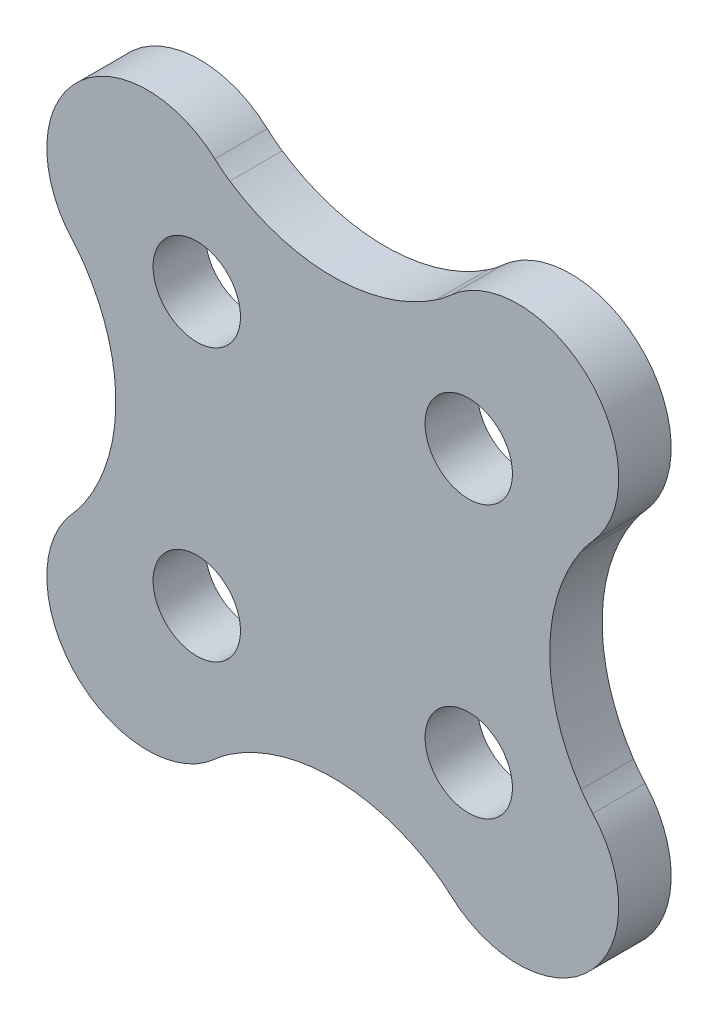
ISO-10303-21;
HEADER;
FILE_DESCRIPTION(('STEP AP214'),'2;1');
FILE_NAME('part.step','',(''),(''),'','','');
FILE_SCHEMA(('AUTOMOTIVE_DESIGN { 1 0 10303 214 1 1 1 1 }'));
ENDSEC;
DATA;
#1=APPLICATION_CONTEXT('core data for automotive mechanical design processes');
#2=APPLICATION_PROTOCOL_DEFINITION('international standard','automotive_design',2000,#1);
#3=PRODUCT_CONTEXT('',#1,'mechanical');
#4=PRODUCT('Part','Part','',(#3));
#5=PRODUCT_RELATED_PRODUCT_CATEGORY('part','',(#4));
#6=PRODUCT_DEFINITION_FORMATION('','',#4);
#7=PRODUCT_DEFINITION_CONTEXT('part definition',#1,'design');
#8=PRODUCT_DEFINITION('design','',#6,#7);
#9=PRODUCT_DEFINITION_SHAPE('','',#8);
#10=(LENGTH_UNIT() NAMED_UNIT(*) SI_UNIT(.MILLI.,.METRE.));
#11=(NAMED_UNIT(*) PLANE_ANGLE_UNIT() SI_UNIT($,.RADIAN.));
#12=(NAMED_UNIT(*) SI_UNIT($,.STERADIAN.) SOLID_ANGLE_UNIT());
#13=UNCERTAINTY_MEASURE_WITH_UNIT(LENGTH_MEASURE(1.E-05),#10,'distance_accuracy_value','');
#14=(GEOMETRIC_REPRESENTATION_CONTEXT(3) GLOBAL_UNCERTAINTY_ASSIGNED_CONTEXT((#13)) GLOBAL_UNIT_ASSIGNED_CONTEXT((#10,
#11,#12)) REPRESENTATION_CONTEXT('',''));
#15=CARTESIAN_POINT('',(0.,0.,0.));
#16=DIRECTION('',(0.,0.,1.));
#17=DIRECTION('',(1.,0.,0.));
#18=AXIS2_PLACEMENT_3D('',#15,#16,#17);
#19=CARTESIAN_POINT('',(8.97753154086215,16.3429104568438,1.2));
#20=DIRECTION('',(0.,0.,1.));
#21=DIRECTION('',(1.,0.,0.));
#22=AXIS2_PLACEMENT_3D('',#19,#20,#21);
#23=PLANE('',#22);
#24=CARTESIAN_POINT('',(12.0735176604385,16.989962178256,1.2));
#25=DIRECTION('',(0.,0.,1.));
#26=DIRECTION('',(1.,0.,0.));
#27=AXIS2_PLACEMENT_3D('',#24,#25,#26);
#28=CIRCLE('',#27,1.);
#29=CARTESIAN_POINT('',(13.0735176604385,16.989962178256,1.2));
#30=VERTEX_POINT('',#29);
#31=EDGE_CURVE('E773',#30,#30,#28,.T.);
#32=ORIENTED_EDGE('',*,*,#31,.F.);
#33=EDGE_LOOP('',(#32));
#34=FACE_BOUND('',#33,.T.);
#35=CARTESIAN_POINT('',(18.29605733488,10.7674225038145,1.2));
#36=DIRECTION('',(0.,0.,1.));
#37=DIRECTION('',(1.,0.,0.));
#38=AXIS2_PLACEMENT_3D('',#35,#36,#37);
#39=CIRCLE('',#38,1.);
#40=CARTESIAN_POINT('',(19.29605733488,10.7674225038145,1.2));
#41=VERTEX_POINT('',#40);
#42=EDGE_CURVE('E396',#41,#41,#39,.T.);
#43=ORIENTED_EDGE('',*,*,#42,.F.);
#44=EDGE_LOOP('',(#43));
#45=FACE_BOUND('',#44,.T.);
#46=CARTESIAN_POINT('',(10.94214681054,18.1213330281545,1.2));
#47=DIRECTION('',(0.,0.,1.));
#48=DIRECTION('',(1.,0.,0.));
#49=AXIS2_PLACEMENT_3D('',#46,#47,#48);
#50=CIRCLE('',#49,2.30000000000002);
#51=CARTESIAN_POINT('',(12.4856833818662,19.8264708093848,1.2));
#52=VERTEX_POINT('',#51);
#53=CARTESIAN_POINT('',(9.23700902930997,16.5777964568282,1.2));
#54=VERTEX_POINT('',#53);
#55=EDGE_CURVE('E322',#52,#54,#50,.T.);
#56=ORIENTED_EDGE('',*,*,#55,.T.);
#57=CARTESIAN_POINT('',(7.01291627118427,14.564487885533,1.2));
#58=DIRECTION('',(0.,0.,1.));
#59=DIRECTION('',(1.,0.,0.));
#60=AXIS2_PLACEMENT_3D('',#57,#58,#59);
#61=CIRCLE('',#60,2.99999999999961);
#62=CARTESIAN_POINT('',(9.50489487840609,16.2348299526398,1.2));
#63=VERTEX_POINT('',#62);
#64=EDGE_CURVE('E510',#63,#54,#61,.T.);
#65=ORIENTED_EDGE('',*,*,#64,.F.);
#66=CARTESIAN_POINT('',(5.98977983735266,13.8786923410353,1.2));
#67=DIRECTION('',(0.,0.,1.));
#68=DIRECTION('',(1.,0.,0.));
#69=AXIS2_PLACEMENT_3D('',#66,#67,#68);
#70=CIRCLE('',#69,4.23171575092862);
#71=CARTESIAN_POINT('',(9.50489487840625,11.5225547294311,1.2));
#72=VERTEX_POINT('',#71);
#73=EDGE_CURVE('E495',#72,#63,#70,.T.);
#74=ORIENTED_EDGE('',*,*,#73,.F.);
#75=CARTESIAN_POINT('',(7.01291627118376,13.192896796537,1.2));
#76=DIRECTION('',(0.,0.,1.));
#77=DIRECTION('',(1.,0.,0.));
#78=AXIS2_PLACEMENT_3D('',#75,#76,#77);
#79=CIRCLE('',#78,2.99999999999973);
#80=CARTESIAN_POINT('',(9.23700902930996,11.1795882252423,1.2));
#81=VERTEX_POINT('',#80);
#82=EDGE_CURVE('E509',#81,#72,#79,.T.);
#83=ORIENTED_EDGE('',*,*,#82,.F.);
#84=CARTESIAN_POINT('',(10.9421468105401,9.63605165391596,1.2));
#85=DIRECTION('',(0.,0.,1.));
#86=DIRECTION('',(1.,0.,0.));
#87=AXIS2_PLACEMENT_3D('',#84,#85,#86);
#88=CIRCLE('',#87,2.30000000000002);
#89=CARTESIAN_POINT('',(12.4856833818663,7.9309138726858,1.2));
#90=VERTEX_POINT('',#89);
#91=EDGE_CURVE('E515',#81,#90,#88,.T.);
#92=ORIENTED_EDGE('',*,*,#91,.T.);
#93=CARTESIAN_POINT('',(14.4989919531628,5.70682111455984,1.2));
#94=DIRECTION('',(0.,0.,1.));
#95=DIRECTION('',(1.,0.,0.));
#96=AXIS2_PLACEMENT_3D('',#93,#94,#95);
#97=CIRCLE('',#96,3.00000000000069);
#98=CARTESIAN_POINT('',(12.828649886055,8.19879972178226,1.2));
#99=VERTEX_POINT('',#98);
#100=EDGE_CURVE('E522',#99,#90,#97,.T.);
#101=ORIENTED_EDGE('',*,*,#100,.F.);
#102=CARTESIAN_POINT('',(15.1847874976592,4.68368468072872,1.2));
#103=DIRECTION('',(0.,0.,1.));
#104=DIRECTION('',(1.,0.,0.));
#105=AXIS2_PLACEMENT_3D('',#102,#103,#104);
#106=CIRCLE('',#105,4.23171575092856);
#107=CARTESIAN_POINT('',(17.5409251092637,8.19879972178209,1.2));
#108=VERTEX_POINT('',#107);
#109=EDGE_CURVE('E526',#108,#99,#106,.T.);
#110=ORIENTED_EDGE('',*,*,#109,.F.);
#111=CARTESIAN_POINT('',(15.8705830421569,5.70682111456031,1.2));
#112=DIRECTION('',(0.,0.,1.));
#113=DIRECTION('',(1.,0.,0.));
#114=AXIS2_PLACEMENT_3D('',#111,#112,#113);
#115=CIRCLE('',#114,2.9999999999996);
#116=CARTESIAN_POINT('',(17.8838916134524,7.9309138726857,1.2));
#117=VERTEX_POINT('',#116);
#118=EDGE_CURVE('E530',#117,#108,#115,.T.);
#119=ORIENTED_EDGE('',*,*,#118,.F.);
#120=CARTESIAN_POINT('',(19.4274281847784,9.63605165391604,1.2));
#121=DIRECTION('',(0.,0.,1.));
#122=DIRECTION('',(1.,0.,0.));
#123=AXIS2_PLACEMENT_3D('',#120,#121,#122);
#124=CIRCLE('',#123,2.30000000000002);
#125=CARTESIAN_POINT('',(21.1325659660086,11.1795882252423,1.2));
#126=VERTEX_POINT('',#125);
#127=EDGE_CURVE('E534',#117,#126,#124,.T.);
#128=ORIENTED_EDGE('',*,*,#127,.T.);
#129=CARTESIAN_POINT('',(23.3566587241348,13.192896796537,1.2));
#130=DIRECTION('',(0.,0.,1.));
#131=DIRECTION('',(1.,0.,0.));
#132=AXIS2_PLACEMENT_3D('',#129,#130,#131);
#133=CIRCLE('',#132,2.99999999999973);
#134=CARTESIAN_POINT('',(20.8646801169123,11.5225547294311,1.2));
#135=VERTEX_POINT('',#134);
#136=EDGE_CURVE('E537',#135,#126,#133,.T.);
#137=ORIENTED_EDGE('',*,*,#136,.F.);
#138=CARTESIAN_POINT('',(24.3797951579659,13.8786923410353,1.2));
#139=DIRECTION('',(0.,0.,1.));
#140=DIRECTION('',(1.,0.,0.));
#141=AXIS2_PLACEMENT_3D('',#138,#139,#140);
#142=CIRCLE('',#141,4.23171575092862);
#143=CARTESIAN_POINT('',(20.8646801169124,16.2348299526398,1.2));
#144=VERTEX_POINT('',#143);
#145=EDGE_CURVE('E541',#144,#135,#142,.T.);
#146=ORIENTED_EDGE('',*,*,#145,.F.);
#147=CARTESIAN_POINT('',(23.3566587241343,14.564487885533,1.2));
#148=DIRECTION('',(0.,0.,1.));
#149=DIRECTION('',(1.,0.,0.));
#150=AXIS2_PLACEMENT_3D('',#147,#148,#149);
#151=CIRCLE('',#150,2.99999999999962);
#152=CARTESIAN_POINT('',(21.1325659660086,16.5777964568282,1.2));
#153=VERTEX_POINT('',#152);
#154=EDGE_CURVE('E545',#153,#144,#151,.T.);
#155=ORIENTED_EDGE('',*,*,#154,.F.);
#156=CARTESIAN_POINT('',(19.4274281847785,18.1213330281545,1.2));
#157=DIRECTION('',(0.,0.,1.));
#158=DIRECTION('',(1.,0.,0.));
#159=AXIS2_PLACEMENT_3D('',#156,#157,#158);
#160=CIRCLE('',#159,2.30000000000003);
#161=CARTESIAN_POINT('',(17.8838916134523,19.8264708093848,1.2));
#162=VERTEX_POINT('',#161);
#163=EDGE_CURVE('E380',#153,#162,#160,.T.);
#164=ORIENTED_EDGE('',*,*,#163,.T.);
#165=CARTESIAN_POINT('',(15.870583042157,22.0505635675103,1.2));
#166=DIRECTION('',(0.,0.,1.));
#167=DIRECTION('',(1.,0.,0.));
#168=AXIS2_PLACEMENT_3D('',#165,#166,#167);
#169=CIRCLE('',#168,2.99999999999965);
#170=CARTESIAN_POINT('',(17.5409251092636,19.5585849602883,1.2));
#171=VERTEX_POINT('',#170);
#172=EDGE_CURVE('E366',#171,#162,#169,.T.);
#173=ORIENTED_EDGE('',*,*,#172,.F.);
#174=CARTESIAN_POINT('',(15.1847874976593,23.0737000013419,1.2));
#175=DIRECTION('',(0.,0.,1.));
#176=DIRECTION('',(1.,0.,0.));
#177=AXIS2_PLACEMENT_3D('',#174,#175,#176);
#178=CIRCLE('',#177,4.23171575092862);
#179=CARTESIAN_POINT('',(12.828649886055,19.5585849602884,1.2));
#180=VERTEX_POINT('',#179);
#181=EDGE_CURVE('E377',#180,#171,#178,.T.);
#182=ORIENTED_EDGE('',*,*,#181,.F.);
#183=CARTESIAN_POINT('',(14.4989919531611,22.0505635675107,1.2));
#184=DIRECTION('',(0.,0.,1.));
#185=DIRECTION('',(1.,0.,0.));
#186=AXIS2_PLACEMENT_3D('',#183,#184,#185);
#187=CIRCLE('',#186,2.99999999999961);
#188=EDGE_CURVE('E386',#52,#180,#187,.T.);
#189=ORIENTED_EDGE('',*,*,#188,.F.);
#190=EDGE_LOOP('',(#56,#65,#74,#83,#92,#101,#110,#119,#128,#137,#146,#155,#164,#173,#182,#189));
#191=FACE_BOUND('',#190,.T.);
#192=CARTESIAN_POINT('',(12.0735176604385,10.7674225038145,1.2));
#193=DIRECTION('',(0.,0.,1.));
#194=DIRECTION('',(1.,0.,0.));
#195=AXIS2_PLACEMENT_3D('',#192,#193,#194);
#196=CIRCLE('',#195,0.999999999999999);
#197=CARTESIAN_POINT('',(13.0735176604385,10.7674225038145,1.2));
#198=VERTEX_POINT('',#197);
#199=EDGE_CURVE('E765',#198,#198,#196,.T.);
#200=ORIENTED_EDGE('',*,*,#199,.F.);
#201=EDGE_LOOP('',(#200));
#202=FACE_BOUND('',#201,.T.);
#203=CARTESIAN_POINT('',(18.29605733488,16.989962178256,1.2));
#204=DIRECTION('',(0.,0.,1.));
#205=DIRECTION('',(1.,0.,0.));
#206=AXIS2_PLACEMENT_3D('',#203,#204,#205);
#207=CIRCLE('',#206,1.);
#208=CARTESIAN_POINT('',(19.29605733488,16.989962178256,1.2));
#209=VERTEX_POINT('',#208);
#210=EDGE_CURVE('E781',#209,#209,#207,.T.);
#211=ORIENTED_EDGE('',*,*,#210,.F.);
#212=EDGE_LOOP('',(#211));
#213=FACE_BOUND('',#212,.T.);
#214=ADVANCED_FACE('F243',(#34,#45,#191,#202,#213),#23,.T.);
#215=CARTESIAN_POINT('',(8.97753154086215,16.3429104568438,0.));
#216=DIRECTION('',(0.,0.,1.));
#217=DIRECTION('',(1.,0.,0.));
#218=AXIS2_PLACEMENT_3D('',#215,#216,#217);
#219=PLANE('',#218);
#220=CARTESIAN_POINT('',(10.94214681054,18.1213330281545,0.));
#221=DIRECTION('',(0.,0.,1.));
#222=DIRECTION('',(1.,0.,0.));
#223=AXIS2_PLACEMENT_3D('',#220,#221,#222);
#224=CIRCLE('',#223,2.30000000000002);
#225=CARTESIAN_POINT('',(12.4856833818662,19.8264708093848,0.));
#226=VERTEX_POINT('',#225);
#227=CARTESIAN_POINT('',(9.23700902930997,16.5777964568282,0.));
#228=VERTEX_POINT('',#227);
#229=EDGE_CURVE('E392',#226,#228,#224,.T.);
#230=ORIENTED_EDGE('',*,*,#229,.F.);
#231=CARTESIAN_POINT('',(14.4989919531611,22.0505635675107,0.));
#232=DIRECTION('',(0.,0.,1.));
#233=DIRECTION('',(1.,0.,0.));
#234=AXIS2_PLACEMENT_3D('',#231,#232,#233);
#235=CIRCLE('',#234,2.99999999999961);
#236=CARTESIAN_POINT('',(12.828649886055,19.5585849602884,0.));
#237=VERTEX_POINT('',#236);
#238=EDGE_CURVE('E449',#226,#237,#235,.T.);
#239=ORIENTED_EDGE('',*,*,#238,.T.);
#240=CARTESIAN_POINT('',(15.1847874976593,23.0737000013419,0.));
#241=DIRECTION('',(0.,0.,1.));
#242=DIRECTION('',(1.,0.,0.));
#243=AXIS2_PLACEMENT_3D('',#240,#241,#242);
#244=CIRCLE('',#243,4.23171575092862);
#245=CARTESIAN_POINT('',(17.5409251092636,19.5585849602883,0.));
#246=VERTEX_POINT('',#245);
#247=EDGE_CURVE('E446',#237,#246,#244,.T.);
#248=ORIENTED_EDGE('',*,*,#247,.T.);
#249=CARTESIAN_POINT('',(15.870583042157,22.0505635675103,0.));
#250=DIRECTION('',(0.,0.,1.));
#251=DIRECTION('',(1.,0.,0.));
#252=AXIS2_PLACEMENT_3D('',#249,#250,#251);
#253=CIRCLE('',#252,2.99999999999965);
#254=CARTESIAN_POINT('',(17.8838916134523,19.8264708093848,0.));
#255=VERTEX_POINT('',#254);
#256=EDGE_CURVE('E368',#246,#255,#253,.T.);
#257=ORIENTED_EDGE('',*,*,#256,.T.);
#258=CARTESIAN_POINT('',(19.4274281847785,18.1213330281545,0.));
#259=DIRECTION('',(0.,0.,1.));
#260=DIRECTION('',(1.,0.,0.));
#261=AXIS2_PLACEMENT_3D('',#258,#259,#260);
#262=CIRCLE('',#261,2.30000000000003);
#263=CARTESIAN_POINT('',(21.1325659660086,16.5777964568282,0.));
#264=VERTEX_POINT('',#263);
#265=EDGE_CURVE('E440',#264,#255,#262,.T.);
#266=ORIENTED_EDGE('',*,*,#265,.F.);
#267=CARTESIAN_POINT('',(23.3566587241343,14.564487885533,0.));
#268=DIRECTION('',(0.,0.,1.));
#269=DIRECTION('',(1.,0.,0.));
#270=AXIS2_PLACEMENT_3D('',#267,#268,#269);
#271=CIRCLE('',#270,2.99999999999962);
#272=CARTESIAN_POINT('',(20.8646801169124,16.2348299526398,0.));
#273=VERTEX_POINT('',#272);
#274=EDGE_CURVE('E436',#264,#273,#271,.T.);
#275=ORIENTED_EDGE('',*,*,#274,.T.);
#276=CARTESIAN_POINT('',(24.3797951579659,13.8786923410353,0.));
#277=DIRECTION('',(0.,0.,1.));
#278=DIRECTION('',(1.,0.,0.));
#279=AXIS2_PLACEMENT_3D('',#276,#277,#278);
#280=CIRCLE('',#279,4.23171575092862);
#281=CARTESIAN_POINT('',(20.8646801169123,11.5225547294311,0.));
#282=VERTEX_POINT('',#281);
#283=EDGE_CURVE('E432',#273,#282,#280,.T.);
#284=ORIENTED_EDGE('',*,*,#283,.T.);
#285=CARTESIAN_POINT('',(23.3566587241348,13.192896796537,0.));
#286=DIRECTION('',(0.,0.,1.));
#287=DIRECTION('',(1.,0.,0.));
#288=AXIS2_PLACEMENT_3D('',#285,#286,#287);
#289=CIRCLE('',#288,2.99999999999973);
#290=CARTESIAN_POINT('',(21.1325659660086,11.1795882252423,0.));
#291=VERTEX_POINT('',#290);
#292=EDGE_CURVE('E428',#282,#291,#289,.T.);
#293=ORIENTED_EDGE('',*,*,#292,.T.);
#294=CARTESIAN_POINT('',(19.4274281847784,9.63605165391604,0.));
#295=DIRECTION('',(0.,0.,1.));
#296=DIRECTION('',(1.,0.,0.));
#297=AXIS2_PLACEMENT_3D('',#294,#295,#296);
#298=CIRCLE('',#297,2.30000000000002);
#299=CARTESIAN_POINT('',(17.8838916134524,7.9309138726857,0.));
#300=VERTEX_POINT('',#299);
#301=EDGE_CURVE('E424',#300,#291,#298,.T.);
#302=ORIENTED_EDGE('',*,*,#301,.F.);
#303=CARTESIAN_POINT('',(15.8705830421569,5.70682111456031,0.));
#304=DIRECTION('',(0.,0.,1.));
#305=DIRECTION('',(1.,0.,0.));
#306=AXIS2_PLACEMENT_3D('',#303,#304,#305);
#307=CIRCLE('',#306,2.9999999999996);
#308=CARTESIAN_POINT('',(17.5409251092637,8.19879972178209,0.));
#309=VERTEX_POINT('',#308);
#310=EDGE_CURVE('E420',#300,#309,#307,.T.);
#311=ORIENTED_EDGE('',*,*,#310,.T.);
#312=CARTESIAN_POINT('',(15.1847874976592,4.68368468072872,0.));
#313=DIRECTION('',(0.,0.,1.));
#314=DIRECTION('',(1.,0.,0.));
#315=AXIS2_PLACEMENT_3D('',#312,#313,#314);
#316=CIRCLE('',#315,4.23171575092856);
#317=CARTESIAN_POINT('',(12.828649886055,8.19879972178226,0.));
#318=VERTEX_POINT('',#317);
#319=EDGE_CURVE('E416',#309,#318,#316,.T.);
#320=ORIENTED_EDGE('',*,*,#319,.T.);
#321=CARTESIAN_POINT('',(14.4989919531628,5.70682111455984,0.));
#322=DIRECTION('',(0.,0.,1.));
#323=DIRECTION('',(1.,0.,0.));
#324=AXIS2_PLACEMENT_3D('',#321,#322,#323);
#325=CIRCLE('',#324,3.00000000000069);
#326=CARTESIAN_POINT('',(12.4856833818663,7.9309138726858,0.));
#327=VERTEX_POINT('',#326);
#328=EDGE_CURVE('E412',#318,#327,#325,.T.);
#329=ORIENTED_EDGE('',*,*,#328,.T.);
#330=CARTESIAN_POINT('',(10.9421468105401,9.63605165391596,0.));
#331=DIRECTION('',(0.,0.,1.));
#332=DIRECTION('',(1.,0.,0.));
#333=AXIS2_PLACEMENT_3D('',#330,#331,#332);
#334=CIRCLE('',#333,2.30000000000002);
#335=CARTESIAN_POINT('',(9.23700902930996,11.1795882252423,0.));
#336=VERTEX_POINT('',#335);
#337=EDGE_CURVE('E408',#336,#327,#334,.T.);
#338=ORIENTED_EDGE('',*,*,#337,.F.);
#339=CARTESIAN_POINT('',(7.01291627118376,13.192896796537,0.));
#340=DIRECTION('',(0.,0.,1.));
#341=DIRECTION('',(1.,0.,0.));
#342=AXIS2_PLACEMENT_3D('',#339,#340,#341);
#343=CIRCLE('',#342,2.99999999999973);
#344=CARTESIAN_POINT('',(9.50489487840625,11.5225547294311,0.));
#345=VERTEX_POINT('',#344);
#346=EDGE_CURVE('E404',#336,#345,#343,.T.);
#347=ORIENTED_EDGE('',*,*,#346,.T.);
#348=CARTESIAN_POINT('',(5.98977983735266,13.8786923410353,0.));
#349=DIRECTION('',(0.,0.,1.));
#350=DIRECTION('',(1.,0.,0.));
#351=AXIS2_PLACEMENT_3D('',#348,#349,#350);
#352=CIRCLE('',#351,4.23171575092862);
#353=CARTESIAN_POINT('',(9.50489487840609,16.2348299526398,0.));
#354=VERTEX_POINT('',#353);
#355=EDGE_CURVE('E400',#345,#354,#352,.T.);
#356=ORIENTED_EDGE('',*,*,#355,.T.);
#357=CARTESIAN_POINT('',(7.01291627118427,14.564487885533,0.));
#358=DIRECTION('',(0.,0.,1.));
#359=DIRECTION('',(1.,0.,0.));
#360=AXIS2_PLACEMENT_3D('',#357,#358,#359);
#361=CIRCLE('',#360,2.99999999999961);
#362=EDGE_CURVE('E395',#354,#228,#361,.T.);
#363=ORIENTED_EDGE('',*,*,#362,.T.);
#364=EDGE_LOOP('',(#230,#239,#248,#257,#266,#275,#284,#293,#302,#311,#320,#329,#338,#347,#356,#363));
#365=FACE_BOUND('',#364,.T.);
#366=CARTESIAN_POINT('',(18.29605733488,10.7674225038145,0.));
#367=DIRECTION('',(0.,0.,1.));
#368=DIRECTION('',(1.,0.,0.));
#369=AXIS2_PLACEMENT_3D('',#366,#367,#368);
#370=CIRCLE('',#369,1.);
#371=CARTESIAN_POINT('',(19.29605733488,10.7674225038145,0.));
#372=VERTEX_POINT('',#371);
#373=EDGE_CURVE('E761',#372,#372,#370,.T.);
#374=ORIENTED_EDGE('',*,*,#373,.T.);
#375=EDGE_LOOP('',(#374));
#376=FACE_BOUND('',#375,.T.);
#377=CARTESIAN_POINT('',(12.0735176604385,10.7674225038145,0.));
#378=DIRECTION('',(0.,0.,1.));
#379=DIRECTION('',(1.,0.,0.));
#380=AXIS2_PLACEMENT_3D('',#377,#378,#379);
#381=CIRCLE('',#380,0.999999999999999);
#382=CARTESIAN_POINT('',(13.0735176604385,10.7674225038145,0.));
#383=VERTEX_POINT('',#382);
#384=EDGE_CURVE('E769',#383,#383,#381,.T.);
#385=ORIENTED_EDGE('',*,*,#384,.T.);
#386=EDGE_LOOP('',(#385));
#387=FACE_BOUND('',#386,.T.);
#388=CARTESIAN_POINT('',(12.0735176604385,16.989962178256,0.));
#389=DIRECTION('',(0.,0.,1.));
#390=DIRECTION('',(1.,0.,0.));
#391=AXIS2_PLACEMENT_3D('',#388,#389,#390);
#392=CIRCLE('',#391,1.);
#393=CARTESIAN_POINT('',(13.0735176604385,16.989962178256,0.));
#394=VERTEX_POINT('',#393);
#395=EDGE_CURVE('E777',#394,#394,#392,.T.);
#396=ORIENTED_EDGE('',*,*,#395,.T.);
#397=EDGE_LOOP('',(#396));
#398=FACE_BOUND('',#397,.T.);
#399=CARTESIAN_POINT('',(18.29605733488,16.989962178256,0.));
#400=DIRECTION('',(0.,0.,1.));
#401=DIRECTION('',(1.,0.,0.));
#402=AXIS2_PLACEMENT_3D('',#399,#400,#401);
#403=CIRCLE('',#402,1.);
#404=CARTESIAN_POINT('',(19.29605733488,16.989962178256,0.));
#405=VERTEX_POINT('',#404);
#406=EDGE_CURVE('E785',#405,#405,#403,.T.);
#407=ORIENTED_EDGE('',*,*,#406,.T.);
#408=EDGE_LOOP('',(#407));
#409=FACE_BOUND('',#408,.T.);
#410=ADVANCED_FACE('F500',(#365,#376,#387,#398,#409),#219,.F.);
#411=CARTESIAN_POINT('',(10.94214681054,18.1213330281545,1.2));
#412=DIRECTION('',(0.,0.,-1.));
#413=DIRECTION('',(-1.,0.,0.));
#414=AXIS2_PLACEMENT_3D('',#411,#412,#413);
#415=CYLINDRICAL_SURFACE('',#414,2.30000000000002);
#416=ORIENTED_EDGE('',*,*,#229,.T.);
#417=DIRECTION('',(0.,0.,-1.));
#418=VECTOR('',#417,1.);
#419=CARTESIAN_POINT('',(9.23700902930997,16.5777964568282,1.2));
#420=LINE('',#419,#418);
#421=EDGE_CURVE('E12',#54,#228,#420,.T.);
#422=ORIENTED_EDGE('',*,*,#421,.F.);
#423=ORIENTED_EDGE('',*,*,#55,.F.);
#424=DIRECTION('',(0.,0.,-1.));
#425=VECTOR('',#424,1.);
#426=CARTESIAN_POINT('',(12.4856833818662,19.8264708093848,1.2));
#427=LINE('',#426,#425);
#428=EDGE_CURVE('E261',#52,#226,#427,.T.);
#429=ORIENTED_EDGE('',*,*,#428,.T.);
#430=EDGE_LOOP('',(#416,#422,#423,#429));
#431=FACE_BOUND('',#430,.T.);
#432=ADVANCED_FACE('F245',(#431),#415,.T.);
#433=CARTESIAN_POINT('',(7.01291627118427,14.564487885533,1.2));
#434=DIRECTION('',(0.,0.,-1.));
#435=DIRECTION('',(-1.,0.,0.));
#436=AXIS2_PLACEMENT_3D('',#433,#434,#435);
#437=CYLINDRICAL_SURFACE('',#436,2.99999999999961);
#438=ORIENTED_EDGE('',*,*,#362,.F.);
#439=DIRECTION('',(0.,0.,-1.));
#440=VECTOR('',#439,1.);
#441=CARTESIAN_POINT('',(9.50489487840609,16.2348299526398,1.2));
#442=LINE('',#441,#440);
#443=EDGE_CURVE('E253',#63,#354,#442,.T.);
#444=ORIENTED_EDGE('',*,*,#443,.F.);
#445=ORIENTED_EDGE('',*,*,#64,.T.);
#446=ORIENTED_EDGE('',*,*,#421,.T.);
#447=EDGE_LOOP('',(#438,#444,#445,#446));
#448=FACE_BOUND('',#447,.T.);
#449=ADVANCED_FACE('F498',(#448),#437,.F.);
#450=CARTESIAN_POINT('',(5.98977983735266,13.8786923410353,1.2));
#451=DIRECTION('',(0.,0.,-1.));
#452=DIRECTION('',(-1.,0.,0.));
#453=AXIS2_PLACEMENT_3D('',#450,#451,#452);
#454=CYLINDRICAL_SURFACE('',#453,4.23171575092862);
#455=ORIENTED_EDGE('',*,*,#355,.F.);
#456=DIRECTION('',(0.,0.,-1.));
#457=VECTOR('',#456,1.);
#458=CARTESIAN_POINT('',(9.50489487840625,11.5225547294311,1.2));
#459=LINE('',#458,#457);
#460=EDGE_CURVE('E486',#72,#345,#459,.T.);
#461=ORIENTED_EDGE('',*,*,#460,.F.);
#462=ORIENTED_EDGE('',*,*,#73,.T.);
#463=ORIENTED_EDGE('',*,*,#443,.T.);
#464=EDGE_LOOP('',(#455,#461,#462,#463));
#465=FACE_BOUND('',#464,.T.);
#466=ADVANCED_FACE('F493',(#465),#454,.F.);
#467=CARTESIAN_POINT('',(7.01291627118376,13.192896796537,1.2));
#468=DIRECTION('',(0.,0.,-1.));
#469=DIRECTION('',(-1.,0.,0.));
#470=AXIS2_PLACEMENT_3D('',#467,#468,#469);
#471=CYLINDRICAL_SURFACE('',#470,2.99999999999973);
#472=ORIENTED_EDGE('',*,*,#346,.F.);
#473=DIRECTION('',(0.,0.,-1.));
#474=VECTOR('',#473,1.);
#475=CARTESIAN_POINT('',(9.23700902930996,11.1795882252423,1.2));
#476=LINE('',#475,#474);
#477=EDGE_CURVE('E483',#81,#336,#476,.T.);
#478=ORIENTED_EDGE('',*,*,#477,.F.);
#479=ORIENTED_EDGE('',*,*,#82,.T.);
#480=ORIENTED_EDGE('',*,*,#460,.T.);
#481=EDGE_LOOP('',(#472,#478,#479,#480));
#482=FACE_BOUND('',#481,.T.);
#483=ADVANCED_FACE('F505',(#482),#471,.F.);
#484=CARTESIAN_POINT('',(10.9421468105401,9.63605165391596,1.2));
#485=DIRECTION('',(0.,0.,-1.));
#486=DIRECTION('',(-1.,0.,0.));
#487=AXIS2_PLACEMENT_3D('',#484,#485,#486);
#488=CYLINDRICAL_SURFACE('',#487,2.30000000000002);
#489=ORIENTED_EDGE('',*,*,#337,.T.);
#490=DIRECTION('',(0.,0.,-1.));
#491=VECTOR('',#490,1.);
#492=CARTESIAN_POINT('',(12.4856833818663,7.9309138726858,1.2));
#493=LINE('',#492,#491);
#494=EDGE_CURVE('E480',#90,#327,#493,.T.);
#495=ORIENTED_EDGE('',*,*,#494,.F.);
#496=ORIENTED_EDGE('',*,*,#91,.F.);
#497=ORIENTED_EDGE('',*,*,#477,.T.);
#498=EDGE_LOOP('',(#489,#495,#496,#497));
#499=FACE_BOUND('',#498,.T.);
#500=ADVANCED_FACE('F700',(#499),#488,.T.);
#501=CARTESIAN_POINT('',(14.4989919531628,5.70682111455984,1.2));
#502=DIRECTION('',(0.,0.,-1.));
#503=DIRECTION('',(-1.,0.,0.));
#504=AXIS2_PLACEMENT_3D('',#501,#502,#503);
#505=CYLINDRICAL_SURFACE('',#504,3.00000000000069);
#506=ORIENTED_EDGE('',*,*,#328,.F.);
#507=DIRECTION('',(0.,0.,-1.));
#508=VECTOR('',#507,1.);
#509=CARTESIAN_POINT('',(12.828649886055,8.19879972178226,1.2));
#510=LINE('',#509,#508);
#511=EDGE_CURVE('E477',#99,#318,#510,.T.);
#512=ORIENTED_EDGE('',*,*,#511,.F.);
#513=ORIENTED_EDGE('',*,*,#100,.T.);
#514=ORIENTED_EDGE('',*,*,#494,.T.);
#515=EDGE_LOOP('',(#506,#512,#513,#514));
#516=FACE_BOUND('',#515,.T.);
#517=ADVANCED_FACE('F691',(#516),#505,.F.);
#518=CARTESIAN_POINT('',(15.1847874976592,4.68368468072872,1.2));
#519=DIRECTION('',(0.,0.,-1.));
#520=DIRECTION('',(-1.,0.,0.));
#521=AXIS2_PLACEMENT_3D('',#518,#519,#520);
#522=CYLINDRICAL_SURFACE('',#521,4.23171575092856);
#523=ORIENTED_EDGE('',*,*,#319,.F.);
#524=DIRECTION('',(0.,0.,-1.));
#525=VECTOR('',#524,1.);
#526=CARTESIAN_POINT('',(17.5409251092637,8.19879972178209,1.2));
#527=LINE('',#526,#525);
#528=EDGE_CURVE('E474',#108,#309,#527,.T.);
#529=ORIENTED_EDGE('',*,*,#528,.F.);
#530=ORIENTED_EDGE('',*,*,#109,.T.);
#531=ORIENTED_EDGE('',*,*,#511,.T.);
#532=EDGE_LOOP('',(#523,#529,#530,#531));
#533=FACE_BOUND('',#532,.T.);
#534=ADVANCED_FACE('F682',(#533),#522,.F.);
#535=CARTESIAN_POINT('',(15.8705830421569,5.70682111456031,1.2));
#536=DIRECTION('',(0.,0.,-1.));
#537=DIRECTION('',(-1.,0.,0.));
#538=AXIS2_PLACEMENT_3D('',#535,#536,#537);
#539=CYLINDRICAL_SURFACE('',#538,2.9999999999996);
#540=ORIENTED_EDGE('',*,*,#310,.F.);
#541=DIRECTION('',(0.,0.,-1.));
#542=VECTOR('',#541,1.);
#543=CARTESIAN_POINT('',(17.8838916134524,7.9309138726857,1.2));
#544=LINE('',#543,#542);
#545=EDGE_CURVE('E471',#117,#300,#544,.T.);
#546=ORIENTED_EDGE('',*,*,#545,.F.);
#547=ORIENTED_EDGE('',*,*,#118,.T.);
#548=ORIENTED_EDGE('',*,*,#528,.T.);
#549=EDGE_LOOP('',(#540,#546,#547,#548));
#550=FACE_BOUND('',#549,.T.);
#551=ADVANCED_FACE('F673',(#550),#539,.F.);
#552=CARTESIAN_POINT('',(19.4274281847784,9.63605165391604,1.2));
#553=DIRECTION('',(0.,0.,-1.));
#554=DIRECTION('',(-1.,0.,0.));
#555=AXIS2_PLACEMENT_3D('',#552,#553,#554);
#556=CYLINDRICAL_SURFACE('',#555,2.30000000000002);
#557=ORIENTED_EDGE('',*,*,#301,.T.);
#558=DIRECTION('',(0.,0.,-1.));
#559=VECTOR('',#558,1.);
#560=CARTESIAN_POINT('',(21.1325659660086,11.1795882252423,1.2));
#561=LINE('',#560,#559);
#562=EDGE_CURVE('E468',#126,#291,#561,.T.);
#563=ORIENTED_EDGE('',*,*,#562,.F.);
#564=ORIENTED_EDGE('',*,*,#127,.F.);
#565=ORIENTED_EDGE('',*,*,#545,.T.);
#566=EDGE_LOOP('',(#557,#563,#564,#565));
#567=FACE_BOUND('',#566,.T.);
#568=ADVANCED_FACE('F664',(#567),#556,.T.);
#569=CARTESIAN_POINT('',(23.3566587241348,13.192896796537,1.2));
#570=DIRECTION('',(0.,0.,-1.));
#571=DIRECTION('',(-1.,0.,0.));
#572=AXIS2_PLACEMENT_3D('',#569,#570,#571);
#573=CYLINDRICAL_SURFACE('',#572,2.99999999999973);
#574=ORIENTED_EDGE('',*,*,#292,.F.);
#575=DIRECTION('',(0.,0.,-1.));
#576=VECTOR('',#575,1.);
#577=CARTESIAN_POINT('',(20.8646801169123,11.5225547294311,1.2));
#578=LINE('',#577,#576);
#579=EDGE_CURVE('E465',#135,#282,#578,.T.);
#580=ORIENTED_EDGE('',*,*,#579,.F.);
#581=ORIENTED_EDGE('',*,*,#136,.T.);
#582=ORIENTED_EDGE('',*,*,#562,.T.);
#583=EDGE_LOOP('',(#574,#580,#581,#582));
#584=FACE_BOUND('',#583,.T.);
#585=ADVANCED_FACE('F656',(#584),#573,.F.);
#586=CARTESIAN_POINT('',(24.3797951579659,13.8786923410353,1.2));
#587=DIRECTION('',(0.,0.,-1.));
#588=DIRECTION('',(-1.,0.,0.));
#589=AXIS2_PLACEMENT_3D('',#586,#587,#588);
#590=CYLINDRICAL_SURFACE('',#589,4.23171575092862);
#591=ORIENTED_EDGE('',*,*,#283,.F.);
#592=DIRECTION('',(0.,0.,-1.));
#593=VECTOR('',#592,1.);
#594=CARTESIAN_POINT('',(20.8646801169124,16.2348299526398,1.2));
#595=LINE('',#594,#593);
#596=EDGE_CURVE('E462',#144,#273,#595,.T.);
#597=ORIENTED_EDGE('',*,*,#596,.F.);
#598=ORIENTED_EDGE('',*,*,#145,.T.);
#599=ORIENTED_EDGE('',*,*,#579,.T.);
#600=EDGE_LOOP('',(#591,#597,#598,#599));
#601=FACE_BOUND('',#600,.T.);
#602=ADVANCED_FACE('F556',(#601),#590,.F.);
#603=CARTESIAN_POINT('',(23.3566587241343,14.564487885533,1.2));
#604=DIRECTION('',(0.,0.,-1.));
#605=DIRECTION('',(-1.,0.,0.));
#606=AXIS2_PLACEMENT_3D('',#603,#604,#605);
#607=CYLINDRICAL_SURFACE('',#606,2.99999999999962);
#608=ORIENTED_EDGE('',*,*,#274,.F.);
#609=DIRECTION('',(0.,0.,-1.));
#610=VECTOR('',#609,1.);
#611=CARTESIAN_POINT('',(21.1325659660086,16.5777964568282,1.2));
#612=LINE('',#611,#610);
#613=EDGE_CURVE('E459',#153,#264,#612,.T.);
#614=ORIENTED_EDGE('',*,*,#613,.F.);
#615=ORIENTED_EDGE('',*,*,#154,.T.);
#616=ORIENTED_EDGE('',*,*,#596,.T.);
#617=EDGE_LOOP('',(#608,#614,#615,#616));
#618=FACE_BOUND('',#617,.T.);
#619=ADVANCED_FACE('F551',(#618),#607,.F.);
#620=CARTESIAN_POINT('',(19.4274281847785,18.1213330281545,1.2));
#621=DIRECTION('',(0.,0.,-1.));
#622=DIRECTION('',(-1.,0.,0.));
#623=AXIS2_PLACEMENT_3D('',#620,#621,#622);
#624=CYLINDRICAL_SURFACE('',#623,2.30000000000003);
#625=ORIENTED_EDGE('',*,*,#265,.T.);
#626=DIRECTION('',(0.,0.,-1.));
#627=VECTOR('',#626,1.);
#628=CARTESIAN_POINT('',(17.8838916134523,19.8264708093848,1.2));
#629=LINE('',#628,#627);
#630=EDGE_CURVE('E373',#162,#255,#629,.T.);
#631=ORIENTED_EDGE('',*,*,#630,.F.);
#632=ORIENTED_EDGE('',*,*,#163,.F.);
#633=ORIENTED_EDGE('',*,*,#613,.T.);
#634=EDGE_LOOP('',(#625,#631,#632,#633));
#635=FACE_BOUND('',#634,.T.);
#636=ADVANCED_FACE('F560',(#635),#624,.T.);
#637=CARTESIAN_POINT('',(15.870583042157,22.0505635675103,1.2));
#638=DIRECTION('',(0.,0.,-1.));
#639=DIRECTION('',(-1.,0.,0.));
#640=AXIS2_PLACEMENT_3D('',#637,#638,#639);
#641=CYLINDRICAL_SURFACE('',#640,2.99999999999965);
#642=ORIENTED_EDGE('',*,*,#256,.F.);
#643=DIRECTION('',(0.,0.,-1.));
#644=VECTOR('',#643,1.);
#645=CARTESIAN_POINT('',(17.5409251092636,19.5585849602883,1.2));
#646=LINE('',#645,#644);
#647=EDGE_CURVE('E363',#171,#246,#646,.T.);
#648=ORIENTED_EDGE('',*,*,#647,.F.);
#649=ORIENTED_EDGE('',*,*,#172,.T.);
#650=ORIENTED_EDGE('',*,*,#630,.T.);
#651=EDGE_LOOP('',(#642,#648,#649,#650));
#652=FACE_BOUND('',#651,.T.);
#653=ADVANCED_FACE('F365',(#652),#641,.F.);
#654=CARTESIAN_POINT('',(15.1847874976593,23.0737000013419,1.2));
#655=DIRECTION('',(0.,0.,-1.));
#656=DIRECTION('',(-1.,0.,0.));
#657=AXIS2_PLACEMENT_3D('',#654,#655,#656);
#658=CYLINDRICAL_SURFACE('',#657,4.23171575092862);
#659=ORIENTED_EDGE('',*,*,#247,.F.);
#660=DIRECTION('',(0.,0.,-1.));
#661=VECTOR('',#660,1.);
#662=CARTESIAN_POINT('',(12.828649886055,19.5585849602884,1.2));
#663=LINE('',#662,#661);
#664=EDGE_CURVE('E310',#180,#237,#663,.T.);
#665=ORIENTED_EDGE('',*,*,#664,.F.);
#666=ORIENTED_EDGE('',*,*,#181,.T.);
#667=ORIENTED_EDGE('',*,*,#647,.T.);
#668=EDGE_LOOP('',(#659,#665,#666,#667));
#669=FACE_BOUND('',#668,.T.);
#670=ADVANCED_FACE('F384',(#669),#658,.F.);
#671=CARTESIAN_POINT('',(14.4989919531611,22.0505635675107,1.2));
#672=DIRECTION('',(0.,0.,-1.));
#673=DIRECTION('',(-1.,0.,0.));
#674=AXIS2_PLACEMENT_3D('',#671,#672,#673);
#675=CYLINDRICAL_SURFACE('',#674,2.99999999999961);
#676=ORIENTED_EDGE('',*,*,#238,.F.);
#677=ORIENTED_EDGE('',*,*,#428,.F.);
#678=ORIENTED_EDGE('',*,*,#188,.T.);
#679=ORIENTED_EDGE('',*,*,#664,.T.);
#680=EDGE_LOOP('',(#676,#677,#678,#679));
#681=FACE_BOUND('',#680,.T.);
#682=ADVANCED_FACE('F582',(#681),#675,.F.);
#683=CARTESIAN_POINT('',(18.29605733488,10.7674225038145,1.2));
#684=DIRECTION('',(0.,0.,-1.));
#685=DIRECTION('',(-1.,0.,0.));
#686=AXIS2_PLACEMENT_3D('',#683,#684,#685);
#687=CYLINDRICAL_SURFACE('',#686,1.);
#688=ORIENTED_EDGE('',*,*,#42,.T.);
#689=EDGE_LOOP('',(#688));
#690=FACE_BOUND('',#689,.T.);
#691=ORIENTED_EDGE('',*,*,#373,.F.);
#692=EDGE_LOOP('',(#691));
#693=FACE_BOUND('',#692,.T.);
#694=ADVANCED_FACE('F579',(#690,#693),#687,.F.);
#695=CARTESIAN_POINT('',(12.0735176604385,10.7674225038145,1.2));
#696=DIRECTION('',(0.,0.,-1.));
#697=DIRECTION('',(-1.,0.,0.));
#698=AXIS2_PLACEMENT_3D('',#695,#696,#697);
#699=CYLINDRICAL_SURFACE('',#698,0.999999999999999);
#700=ORIENTED_EDGE('',*,*,#199,.T.);
#701=EDGE_LOOP('',(#700));
#702=FACE_BOUND('',#701,.T.);
#703=ORIENTED_EDGE('',*,*,#384,.F.);
#704=EDGE_LOOP('',(#703));
#705=FACE_BOUND('',#704,.T.);
#706=ADVANCED_FACE('F600',(#702,#705),#699,.F.);
#707=CARTESIAN_POINT('',(12.0735176604385,16.989962178256,1.2));
#708=DIRECTION('',(0.,0.,-1.));
#709=DIRECTION('',(-1.,0.,0.));
#710=AXIS2_PLACEMENT_3D('',#707,#708,#709);
#711=CYLINDRICAL_SURFACE('',#710,1.);
#712=ORIENTED_EDGE('',*,*,#31,.T.);
#713=EDGE_LOOP('',(#712));
#714=FACE_BOUND('',#713,.T.);
#715=ORIENTED_EDGE('',*,*,#395,.F.);
#716=EDGE_LOOP('',(#715));
#717=FACE_BOUND('',#716,.T.);
#718=ADVANCED_FACE('F607',(#714,#717),#711,.F.);
#719=CARTESIAN_POINT('',(18.29605733488,16.989962178256,1.2));
#720=DIRECTION('',(0.,0.,-1.));
#721=DIRECTION('',(-1.,0.,0.));
#722=AXIS2_PLACEMENT_3D('',#719,#720,#721);
#723=CYLINDRICAL_SURFACE('',#722,1.);
#724=ORIENTED_EDGE('',*,*,#210,.T.);
#725=EDGE_LOOP('',(#724));
#726=FACE_BOUND('',#725,.T.);
#727=ORIENTED_EDGE('',*,*,#406,.F.);
#728=EDGE_LOOP('',(#727));
#729=FACE_BOUND('',#728,.T.);
#730=ADVANCED_FACE('F614',(#726,#729),#723,.F.);
#731=CLOSED_SHELL('',(#214,#410,#432,#449,#466,#483,#500,#517,#534,#551,#568,#585,#602,#619,
#636,#653,#670,#682,#694,#706,#718,#730));
#732=MANIFOLD_SOLID_BREP('B2',#731);
#733=ADVANCED_BREP_SHAPE_REPRESENTATION('',(#18,#732),#14);
#734=SHAPE_DEFINITION_REPRESENTATION(#9,#733);
ENDSEC;
END-ISO-10303-21;
